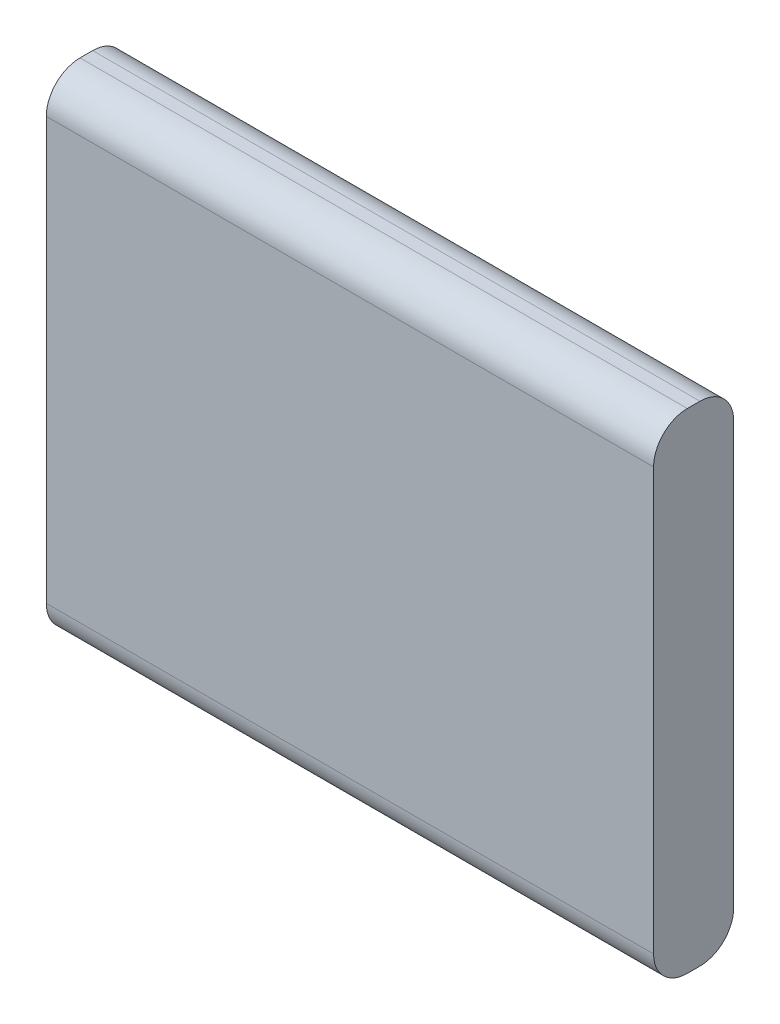
ISO-10303-21;
HEADER;
FILE_DESCRIPTION(('STEP AP214'),'2;1');
FILE_NAME('part.step','',(''),(''),'','','');
FILE_SCHEMA(('AUTOMOTIVE_DESIGN { 1 0 10303 214 1 1 1 1 }'));
ENDSEC;
DATA;
#1=APPLICATION_CONTEXT('core data for automotive mechanical design processes');
#2=APPLICATION_PROTOCOL_DEFINITION('international standard','automotive_design',2000,#1);
#3=PRODUCT_CONTEXT('',#1,'mechanical');
#4=PRODUCT('Part','Part','',(#3));
#5=PRODUCT_RELATED_PRODUCT_CATEGORY('part','',(#4));
#6=PRODUCT_DEFINITION_FORMATION('','',#4);
#7=PRODUCT_DEFINITION_CONTEXT('part definition',#1,'design');
#8=PRODUCT_DEFINITION('design','',#6,#7);
#9=PRODUCT_DEFINITION_SHAPE('','',#8);
#10=(LENGTH_UNIT() NAMED_UNIT(*) SI_UNIT(.MILLI.,.METRE.));
#11=(NAMED_UNIT(*) PLANE_ANGLE_UNIT() SI_UNIT($,.RADIAN.));
#12=(NAMED_UNIT(*) SI_UNIT($,.STERADIAN.) SOLID_ANGLE_UNIT());
#13=UNCERTAINTY_MEASURE_WITH_UNIT(LENGTH_MEASURE(1.E-05),#10,'distance_accuracy_value','');
#14=(GEOMETRIC_REPRESENTATION_CONTEXT(3) GLOBAL_UNCERTAINTY_ASSIGNED_CONTEXT((#13)) GLOBAL_UNIT_ASSIGNED_CONTEXT((#10,
#11,#12)) REPRESENTATION_CONTEXT('',''));
#15=CARTESIAN_POINT('',(0.,0.,0.));
#16=DIRECTION('',(0.,0.,1.));
#17=DIRECTION('',(1.,0.,0.));
#18=AXIS2_PLACEMENT_3D('',#15,#16,#17);
#19=CARTESIAN_POINT('',(18.,14.5,0.));
#20=DIRECTION('',(0.,0.,1.));
#21=DIRECTION('',(1.,0.,0.));
#22=AXIS2_PLACEMENT_3D('',#19,#20,#21);
#23=PLANE('',#22);
#24=DIRECTION('',(-1.,0.,0.));
#25=VECTOR('',#24,1.);
#26=CARTESIAN_POINT('',(27.,27.,0.));
#27=LINE('',#26,#25);
#28=CARTESIAN_POINT('',(36.,27.,0.));
#29=VERTEX_POINT('',#28);
#30=CARTESIAN_POINT('',(0.,27.,0.));
#31=VERTEX_POINT('',#30);
#32=EDGE_CURVE('E135',#29,#31,#27,.T.);
#33=ORIENTED_EDGE('',*,*,#32,.F.);
#34=DIRECTION('',(0.,1.,0.));
#35=VECTOR('',#34,1.);
#36=CARTESIAN_POINT('',(36.,0.,0.));
#37=LINE('',#36,#35);
#38=CARTESIAN_POINT('',(36.,2.,0.));
#39=VERTEX_POINT('',#38);
#40=EDGE_CURVE('E186',#39,#29,#37,.T.);
#41=ORIENTED_EDGE('',*,*,#40,.F.);
#42=DIRECTION('',(1.,0.,0.));
#43=VECTOR('',#42,1.);
#44=CARTESIAN_POINT('',(9.,2.,0.));
#45=LINE('',#44,#43);
#46=CARTESIAN_POINT('',(0.,2.,0.));
#47=VERTEX_POINT('',#46);
#48=EDGE_CURVE('E147',#47,#39,#45,.T.);
#49=ORIENTED_EDGE('',*,*,#48,.F.);
#50=DIRECTION('',(0.,-1.,0.));
#51=VECTOR('',#50,1.);
#52=CARTESIAN_POINT('',(0.,29.,0.));
#53=LINE('',#52,#51);
#54=EDGE_CURVE('E9',#31,#47,#53,.T.);
#55=ORIENTED_EDGE('',*,*,#54,.F.);
#56=EDGE_LOOP('',(#33,#41,#49,#55));
#57=FACE_BOUND('',#56,.T.);
#58=ADVANCED_FACE('F15',(#57),#23,.F.);
#59=CARTESIAN_POINT('',(0.,29.,0.));
#60=DIRECTION('',(-1.,0.,0.));
#61=DIRECTION('',(0.,1.,0.));
#62=AXIS2_PLACEMENT_3D('',#59,#60,#61);
#63=PLANE('',#62);
#64=CARTESIAN_POINT('',(0.,27.,2.));
#65=DIRECTION('',(1.,0.,0.));
#66=DIRECTION('',(0.,0.707106781186548,-0.707106781186547));
#67=AXIS2_PLACEMENT_3D('',#64,#65,#66);
#68=CIRCLE('',#67,2.);
#69=CARTESIAN_POINT('',(0.,29.,2.));
#70=VERTEX_POINT('',#69);
#71=EDGE_CURVE('E148',#31,#70,#68,.T.);
#72=ORIENTED_EDGE('',*,*,#71,.F.);
#73=ORIENTED_EDGE('',*,*,#54,.T.);
#74=CARTESIAN_POINT('',(0.,2.,2.));
#75=DIRECTION('',(1.,0.,0.));
#76=DIRECTION('',(0.,-0.707106781186547,-0.707106781186548));
#77=AXIS2_PLACEMENT_3D('',#74,#75,#76);
#78=CIRCLE('',#77,2.);
#79=CARTESIAN_POINT('',(0.,0.,2.));
#80=VERTEX_POINT('',#79);
#81=EDGE_CURVE('E158',#80,#47,#78,.T.);
#82=ORIENTED_EDGE('',*,*,#81,.F.);
#83=DIRECTION('',(0.,0.,1.));
#84=VECTOR('',#83,1.);
#85=CARTESIAN_POINT('',(0.,0.,0.));
#86=LINE('',#85,#84);
#87=CARTESIAN_POINT('',(0.,0.,2.75));
#88=VERTEX_POINT('',#87);
#89=EDGE_CURVE('E146',#80,#88,#86,.T.);
#90=ORIENTED_EDGE('',*,*,#89,.T.);
#91=CARTESIAN_POINT('',(0.,2.,2.75));
#92=DIRECTION('',(1.,0.,0.));
#93=DIRECTION('',(0.,-0.707106781186548,0.707106781186547));
#94=AXIS2_PLACEMENT_3D('',#91,#92,#93);
#95=CIRCLE('',#94,2.);
#96=CARTESIAN_POINT('',(0.,2.,4.75));
#97=VERTEX_POINT('',#96);
#98=EDGE_CURVE('E159',#97,#88,#95,.T.);
#99=ORIENTED_EDGE('',*,*,#98,.F.);
#100=DIRECTION('',(0.,-1.,0.));
#101=VECTOR('',#100,1.);
#102=CARTESIAN_POINT('',(0.,29.,4.75));
#103=LINE('',#102,#101);
#104=CARTESIAN_POINT('',(0.,27.,4.75));
#105=VERTEX_POINT('',#104);
#106=EDGE_CURVE('E26',#105,#97,#103,.T.);
#107=ORIENTED_EDGE('',*,*,#106,.F.);
#108=CARTESIAN_POINT('',(0.,27.,2.75));
#109=DIRECTION('',(1.,0.,0.));
#110=DIRECTION('',(0.,0.707106781186548,0.707106781186547));
#111=AXIS2_PLACEMENT_3D('',#108,#109,#110);
#112=CIRCLE('',#111,2.);
#113=CARTESIAN_POINT('',(0.,29.,2.75));
#114=VERTEX_POINT('',#113);
#115=EDGE_CURVE('E114',#114,#105,#112,.T.);
#116=ORIENTED_EDGE('',*,*,#115,.F.);
#117=DIRECTION('',(0.,0.,1.));
#118=VECTOR('',#117,1.);
#119=CARTESIAN_POINT('',(0.,29.,0.));
#120=LINE('',#119,#118);
#121=EDGE_CURVE('E166',#70,#114,#120,.T.);
#122=ORIENTED_EDGE('',*,*,#121,.F.);
#123=EDGE_LOOP('',(#72,#73,#82,#90,#99,#107,#116,#122));
#124=FACE_BOUND('',#123,.T.);
#125=ADVANCED_FACE('F196',(#124),#63,.T.);
#126=CARTESIAN_POINT('',(18.,14.5,4.75));
#127=DIRECTION('',(0.,0.,1.));
#128=DIRECTION('',(1.,0.,0.));
#129=AXIS2_PLACEMENT_3D('',#126,#127,#128);
#130=PLANE('',#129);
#131=DIRECTION('',(1.,0.,0.));
#132=VECTOR('',#131,1.);
#133=CARTESIAN_POINT('',(27.,27.,4.75));
#134=LINE('',#133,#132);
#135=CARTESIAN_POINT('',(36.,27.,4.75));
#136=VERTEX_POINT('',#135);
#137=EDGE_CURVE('E107',#105,#136,#134,.T.);
#138=ORIENTED_EDGE('',*,*,#137,.F.);
#139=ORIENTED_EDGE('',*,*,#106,.T.);
#140=DIRECTION('',(-1.,0.,0.));
#141=VECTOR('',#140,1.);
#142=CARTESIAN_POINT('',(9.,2.,4.75));
#143=LINE('',#142,#141);
#144=CARTESIAN_POINT('',(36.,2.,4.75));
#145=VERTEX_POINT('',#144);
#146=EDGE_CURVE('E120',#145,#97,#143,.T.);
#147=ORIENTED_EDGE('',*,*,#146,.F.);
#148=DIRECTION('',(0.,1.,0.));
#149=VECTOR('',#148,1.);
#150=CARTESIAN_POINT('',(36.,0.,4.75));
#151=LINE('',#150,#149);
#152=EDGE_CURVE('E118',#145,#136,#151,.T.);
#153=ORIENTED_EDGE('',*,*,#152,.T.);
#154=EDGE_LOOP('',(#138,#139,#147,#153));
#155=FACE_BOUND('',#154,.T.);
#156=ADVANCED_FACE('F17',(#155),#130,.T.);
#157=CARTESIAN_POINT('',(9.,2.,2.75));
#158=DIRECTION('',(1.,0.,0.));
#159=DIRECTION('',(0.,-0.707106781186548,0.707106781186547));
#160=AXIS2_PLACEMENT_3D('',#157,#158,#159);
#161=CYLINDRICAL_SURFACE('',#160,2.);
#162=CARTESIAN_POINT('',(36.,2.,2.75));
#163=DIRECTION('',(-1.,0.,0.));
#164=DIRECTION('',(0.,-0.707106781186548,0.707106781186547));
#165=AXIS2_PLACEMENT_3D('',#162,#163,#164);
#166=CIRCLE('',#165,2.);
#167=CARTESIAN_POINT('',(36.,0.,2.75));
#168=VERTEX_POINT('',#167);
#169=EDGE_CURVE('E124',#168,#145,#166,.T.);
#170=ORIENTED_EDGE('',*,*,#169,.T.);
#171=ORIENTED_EDGE('',*,*,#146,.T.);
#172=ORIENTED_EDGE('',*,*,#98,.T.);
#173=DIRECTION('',(1.,0.,0.));
#174=VECTOR('',#173,1.);
#175=CARTESIAN_POINT('',(9.,0.,2.75));
#176=LINE('',#175,#174);
#177=EDGE_CURVE('E93',#88,#168,#176,.T.);
#178=ORIENTED_EDGE('',*,*,#177,.T.);
#179=EDGE_LOOP('',(#170,#171,#172,#178));
#180=FACE_BOUND('',#179,.T.);
#181=ADVANCED_FACE('F225',(#180),#161,.T.);
#182=CARTESIAN_POINT('',(0.,0.,0.));
#183=DIRECTION('',(0.,-1.,0.));
#184=DIRECTION('',(0.,0.,-1.));
#185=AXIS2_PLACEMENT_3D('',#182,#183,#184);
#186=PLANE('',#185);
#187=DIRECTION('',(-1.,0.,0.));
#188=VECTOR('',#187,1.);
#189=CARTESIAN_POINT('',(9.,0.,2.));
#190=LINE('',#189,#188);
#191=CARTESIAN_POINT('',(36.,0.,2.));
#192=VERTEX_POINT('',#191);
#193=EDGE_CURVE('E81',#192,#80,#190,.T.);
#194=ORIENTED_EDGE('',*,*,#193,.F.);
#195=DIRECTION('',(0.,0.,1.));
#196=VECTOR('',#195,1.);
#197=CARTESIAN_POINT('',(36.,0.,0.));
#198=LINE('',#197,#196);
#199=EDGE_CURVE('E169',#192,#168,#198,.T.);
#200=ORIENTED_EDGE('',*,*,#199,.T.);
#201=ORIENTED_EDGE('',*,*,#177,.F.);
#202=ORIENTED_EDGE('',*,*,#89,.F.);
#203=EDGE_LOOP('',(#194,#200,#201,#202));
#204=FACE_BOUND('',#203,.T.);
#205=ADVANCED_FACE('F221',(#204),#186,.T.);
#206=CARTESIAN_POINT('',(9.,2.,2.));
#207=DIRECTION('',(1.,0.,0.));
#208=DIRECTION('',(0.,-0.707106781186547,-0.707106781186548));
#209=AXIS2_PLACEMENT_3D('',#206,#207,#208);
#210=CYLINDRICAL_SURFACE('',#209,2.);
#211=CARTESIAN_POINT('',(36.,2.,2.));
#212=DIRECTION('',(-1.,0.,0.));
#213=DIRECTION('',(0.,-0.707106781186547,-0.707106781186548));
#214=AXIS2_PLACEMENT_3D('',#211,#212,#213);
#215=CIRCLE('',#214,2.);
#216=EDGE_CURVE('E19',#39,#192,#215,.T.);
#217=ORIENTED_EDGE('',*,*,#216,.T.);
#218=ORIENTED_EDGE('',*,*,#193,.T.);
#219=ORIENTED_EDGE('',*,*,#81,.T.);
#220=ORIENTED_EDGE('',*,*,#48,.T.);
#221=EDGE_LOOP('',(#217,#218,#219,#220));
#222=FACE_BOUND('',#221,.T.);
#223=ADVANCED_FACE('F210',(#222),#210,.T.);
#224=CARTESIAN_POINT('',(27.,27.,2.75));
#225=DIRECTION('',(-1.,0.,0.));
#226=DIRECTION('',(0.,0.707106781186548,0.707106781186547));
#227=AXIS2_PLACEMENT_3D('',#224,#225,#226);
#228=CYLINDRICAL_SURFACE('',#227,2.);
#229=ORIENTED_EDGE('',*,*,#115,.T.);
#230=ORIENTED_EDGE('',*,*,#137,.T.);
#231=CARTESIAN_POINT('',(36.,27.,2.75));
#232=DIRECTION('',(-1.,0.,0.));
#233=DIRECTION('',(0.,0.707106781186548,0.707106781186547));
#234=AXIS2_PLACEMENT_3D('',#231,#232,#233);
#235=CIRCLE('',#234,2.);
#236=CARTESIAN_POINT('',(36.,29.,2.75));
#237=VERTEX_POINT('',#236);
#238=EDGE_CURVE('E112',#136,#237,#235,.T.);
#239=ORIENTED_EDGE('',*,*,#238,.T.);
#240=DIRECTION('',(-1.,0.,0.));
#241=VECTOR('',#240,1.);
#242=CARTESIAN_POINT('',(27.,29.,2.75));
#243=LINE('',#242,#241);
#244=EDGE_CURVE('E143',#237,#114,#243,.T.);
#245=ORIENTED_EDGE('',*,*,#244,.T.);
#246=EDGE_LOOP('',(#229,#230,#239,#245));
#247=FACE_BOUND('',#246,.T.);
#248=ADVANCED_FACE('F109',(#247),#228,.T.);
#249=CARTESIAN_POINT('',(36.,29.,0.));
#250=DIRECTION('',(0.,1.,0.));
#251=DIRECTION('',(1.,0.,0.));
#252=AXIS2_PLACEMENT_3D('',#249,#250,#251);
#253=PLANE('',#252);
#254=DIRECTION('',(1.,0.,0.));
#255=VECTOR('',#254,1.);
#256=CARTESIAN_POINT('',(27.,29.,2.));
#257=LINE('',#256,#255);
#258=CARTESIAN_POINT('',(36.,29.,2.));
#259=VERTEX_POINT('',#258);
#260=EDGE_CURVE('E152',#70,#259,#257,.T.);
#261=ORIENTED_EDGE('',*,*,#260,.F.);
#262=ORIENTED_EDGE('',*,*,#121,.T.);
#263=ORIENTED_EDGE('',*,*,#244,.F.);
#264=DIRECTION('',(0.,0.,1.));
#265=VECTOR('',#264,1.);
#266=CARTESIAN_POINT('',(36.,29.,0.));
#267=LINE('',#266,#265);
#268=EDGE_CURVE('E128',#259,#237,#267,.T.);
#269=ORIENTED_EDGE('',*,*,#268,.F.);
#270=EDGE_LOOP('',(#261,#262,#263,#269));
#271=FACE_BOUND('',#270,.T.);
#272=ADVANCED_FACE('F201',(#271),#253,.T.);
#273=CARTESIAN_POINT('',(36.,0.,0.));
#274=DIRECTION('',(1.,0.,0.));
#275=DIRECTION('',(0.,1.,0.));
#276=AXIS2_PLACEMENT_3D('',#273,#274,#275);
#277=PLANE('',#276);
#278=CARTESIAN_POINT('',(36.,27.,2.));
#279=DIRECTION('',(-1.,0.,0.));
#280=DIRECTION('',(0.,0.707106781186548,-0.707106781186547));
#281=AXIS2_PLACEMENT_3D('',#278,#279,#280);
#282=CIRCLE('',#281,2.);
#283=EDGE_CURVE('E138',#259,#29,#282,.T.);
#284=ORIENTED_EDGE('',*,*,#283,.F.);
#285=ORIENTED_EDGE('',*,*,#268,.T.);
#286=ORIENTED_EDGE('',*,*,#238,.F.);
#287=ORIENTED_EDGE('',*,*,#152,.F.);
#288=ORIENTED_EDGE('',*,*,#169,.F.);
#289=ORIENTED_EDGE('',*,*,#199,.F.);
#290=ORIENTED_EDGE('',*,*,#216,.F.);
#291=ORIENTED_EDGE('',*,*,#40,.T.);
#292=EDGE_LOOP('',(#284,#285,#286,#287,#288,#289,#290,#291));
#293=FACE_BOUND('',#292,.T.);
#294=ADVANCED_FACE('F127',(#293),#277,.T.);
#295=CARTESIAN_POINT('',(27.,27.,2.));
#296=DIRECTION('',(-1.,0.,0.));
#297=DIRECTION('',(0.,0.707106781186548,-0.707106781186547));
#298=AXIS2_PLACEMENT_3D('',#295,#296,#297);
#299=CYLINDRICAL_SURFACE('',#298,2.);
#300=ORIENTED_EDGE('',*,*,#71,.T.);
#301=ORIENTED_EDGE('',*,*,#260,.T.);
#302=ORIENTED_EDGE('',*,*,#283,.T.);
#303=ORIENTED_EDGE('',*,*,#32,.T.);
#304=EDGE_LOOP('',(#300,#301,#302,#303));
#305=FACE_BOUND('',#304,.T.);
#306=ADVANCED_FACE('F181',(#305),#299,.T.);
#307=CLOSED_SHELL('',(#58,#125,#156,#181,#205,#223,#248,#272,#294,#306));
#308=MANIFOLD_SOLID_BREP('B1',#307);
#309=ADVANCED_BREP_SHAPE_REPRESENTATION('',(#18,#308),#14);
#310=SHAPE_DEFINITION_REPRESENTATION(#9,#309);
ENDSEC;
END-ISO-10303-21;
